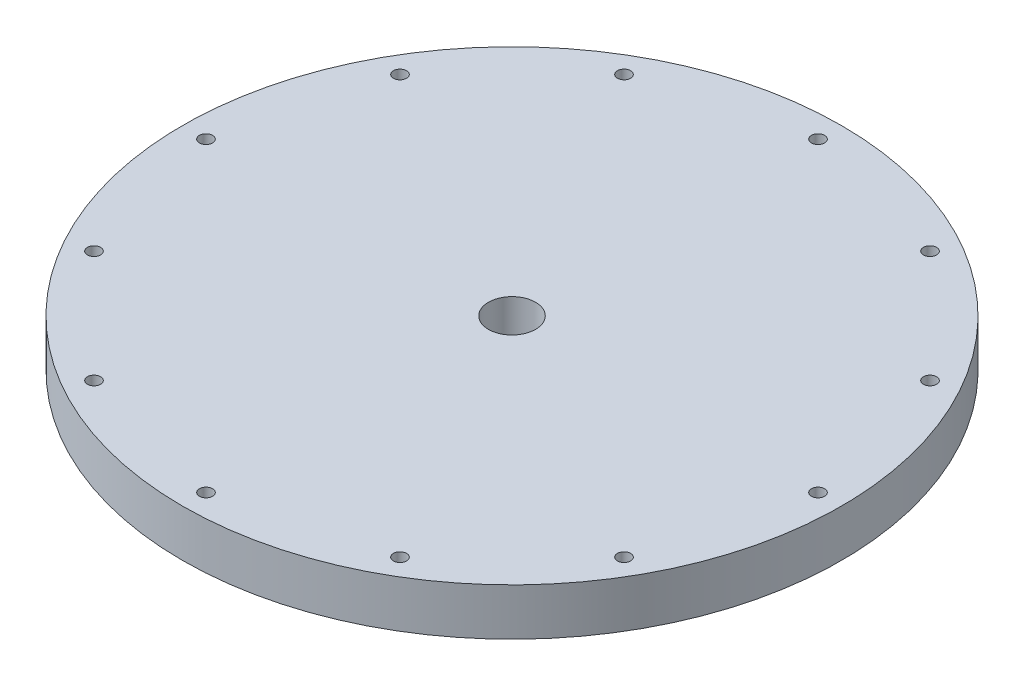
ISO-10303-21;
HEADER;
FILE_DESCRIPTION(('STEP AP214'),'2;1');
FILE_NAME('part.step','',(''),(''),'','','');
FILE_SCHEMA(('AUTOMOTIVE_DESIGN { 1 0 10303 214 1 1 1 1 }'));
ENDSEC;
DATA;
#1=APPLICATION_CONTEXT('core data for automotive mechanical design processes');
#2=APPLICATION_PROTOCOL_DEFINITION('international standard','automotive_design',2000,#1);
#3=PRODUCT_CONTEXT('',#1,'mechanical');
#4=PRODUCT('Part','Part','',(#3));
#5=PRODUCT_RELATED_PRODUCT_CATEGORY('part','',(#4));
#6=PRODUCT_DEFINITION_FORMATION('','',#4);
#7=PRODUCT_DEFINITION_CONTEXT('part definition',#1,'design');
#8=PRODUCT_DEFINITION('design','',#6,#7);
#9=PRODUCT_DEFINITION_SHAPE('','',#8);
#10=(LENGTH_UNIT() NAMED_UNIT(*) SI_UNIT(.MILLI.,.METRE.));
#11=(NAMED_UNIT(*) PLANE_ANGLE_UNIT() SI_UNIT($,.RADIAN.));
#12=(NAMED_UNIT(*) SI_UNIT($,.STERADIAN.) SOLID_ANGLE_UNIT());
#13=UNCERTAINTY_MEASURE_WITH_UNIT(LENGTH_MEASURE(1.E-05),#10,'distance_accuracy_value','');
#14=(GEOMETRIC_REPRESENTATION_CONTEXT(3) GLOBAL_UNCERTAINTY_ASSIGNED_CONTEXT((#13)) GLOBAL_UNIT_ASSIGNED_CONTEXT((#10,
#11,#12)) REPRESENTATION_CONTEXT('',''));
#15=CARTESIAN_POINT('',(0.,0.,0.));
#16=DIRECTION('',(0.,0.,1.));
#17=DIRECTION('',(1.,0.,0.));
#18=AXIS2_PLACEMENT_3D('',#15,#16,#17);
#19=CARTESIAN_POINT('',(0.,49.967071373296,0.));
#20=DIRECTION('',(0.,1.,0.));
#21=DIRECTION('',(0.,0.,1.));
#22=AXIS2_PLACEMENT_3D('',#19,#20,#21);
#23=CYLINDRICAL_SURFACE('',#22,3.175);
#24=CARTESIAN_POINT('',(0.,1.20218446601942,0.));
#25=DIRECTION('',(0.,1.,0.));
#26=DIRECTION('',(0.,0.,1.));
#27=AXIS2_PLACEMENT_3D('',#24,#25,#26);
#28=CIRCLE('',#27,3.175);
#29=CARTESIAN_POINT('',(0.,1.20218446601942,3.175));
#30=VERTEX_POINT('',#29);
#31=EDGE_CURVE('E45',#30,#30,#28,.T.);
#32=ORIENTED_EDGE('',*,*,#31,.T.);
#33=EDGE_LOOP('',(#32));
#34=FACE_BOUND('',#33,.T.);
#35=CARTESIAN_POINT('',(0.,-5.14781553398058,0.));
#36=DIRECTION('',(0.,1.,0.));
#37=DIRECTION('',(0.,0.,1.));
#38=AXIS2_PLACEMENT_3D('',#35,#36,#37);
#39=CIRCLE('',#38,3.175);
#40=CARTESIAN_POINT('',(0.,-5.14781553398058,3.175));
#41=VERTEX_POINT('',#40);
#42=EDGE_CURVE('E10',#41,#41,#39,.T.);
#43=ORIENTED_EDGE('',*,*,#42,.F.);
#44=EDGE_LOOP('',(#43));
#45=FACE_BOUND('',#44,.T.);
#46=ADVANCED_FACE('F31',(#34,#45),#23,.F.);
#47=CARTESIAN_POINT('',(-38.1,-5.14781553398059,0.));
#48=DIRECTION('',(0.,-1.,0.));
#49=DIRECTION('',(0.,0.,-1.));
#50=AXIS2_PLACEMENT_3D('',#47,#48,#49);
#51=PLANE('',#50);
#52=CARTESIAN_POINT('',(-35.7451985412027,-5.14781553398059,-20.6375));
#53=DIRECTION('',(0.,-1.,0.));
#54=DIRECTION('',(0.,0.,-1.));
#55=AXIS2_PLACEMENT_3D('',#52,#53,#54);
#56=CIRCLE('',#55,0.889);
#57=CARTESIAN_POINT('',(-35.7451985412027,-5.14781553398059,-21.5265));
#58=VERTEX_POINT('',#57);
#59=EDGE_CURVE('E56',#58,#58,#56,.T.);
#60=ORIENTED_EDGE('',*,*,#59,.F.);
#61=EDGE_LOOP('',(#60));
#62=FACE_BOUND('',#61,.T.);
#63=CARTESIAN_POINT('',(-20.6374999999999,-5.14781553398059,-35.7451985412028));
#64=DIRECTION('',(0.,-1.,0.));
#65=DIRECTION('',(0.,0.,-1.));
#66=AXIS2_PLACEMENT_3D('',#63,#64,#65);
#67=CIRCLE('',#66,0.889000000000005);
#68=CARTESIAN_POINT('',(-20.6374999999999,-5.14781553398059,-36.6341985412028));
#69=VERTEX_POINT('',#68);
#70=EDGE_CURVE('E59',#69,#69,#67,.T.);
#71=ORIENTED_EDGE('',*,*,#70,.F.);
#72=EDGE_LOOP('',(#71));
#73=FACE_BOUND('',#72,.T.);
#74=CARTESIAN_POINT('',(1.4411089226075E-13,-5.14781553398059,-41.275));
#75=DIRECTION('',(0.,-1.,0.));
#76=DIRECTION('',(0.,0.,-1.));
#77=AXIS2_PLACEMENT_3D('',#74,#75,#76);
#78=CIRCLE('',#77,0.889000000000002);
#79=CARTESIAN_POINT('',(1.4411089226075E-13,-5.14781553398059,-42.164));
#80=VERTEX_POINT('',#79);
#81=EDGE_CURVE('E62',#80,#80,#78,.T.);
#82=ORIENTED_EDGE('',*,*,#81,.F.);
#83=EDGE_LOOP('',(#82));
#84=FACE_BOUND('',#83,.T.);
#85=CARTESIAN_POINT('',(20.6375000000002,-5.14781553398059,-35.7451985412026));
#86=DIRECTION('',(0.,-1.,0.));
#87=DIRECTION('',(0.,0.,-1.));
#88=AXIS2_PLACEMENT_3D('',#85,#86,#87);
#89=CIRCLE('',#88,0.889);
#90=CARTESIAN_POINT('',(20.6375000000002,-5.14781553398059,-36.6341985412026));
#91=VERTEX_POINT('',#90);
#92=EDGE_CURVE('E65',#91,#91,#89,.T.);
#93=ORIENTED_EDGE('',*,*,#92,.F.);
#94=EDGE_LOOP('',(#93));
#95=FACE_BOUND('',#94,.T.);
#96=CARTESIAN_POINT('',(35.7451985412028,-5.14781553398059,-20.6374999999998));
#97=DIRECTION('',(0.,-1.,0.));
#98=DIRECTION('',(0.,0.,-1.));
#99=AXIS2_PLACEMENT_3D('',#96,#97,#98);
#100=CIRCLE('',#99,0.889000000000005);
#101=CARTESIAN_POINT('',(35.7451985412028,-5.14781553398059,-21.5264999999998));
#102=VERTEX_POINT('',#101);
#103=EDGE_CURVE('E68',#102,#102,#100,.T.);
#104=ORIENTED_EDGE('',*,*,#103,.F.);
#105=EDGE_LOOP('',(#104));
#106=FACE_BOUND('',#105,.T.);
#107=CARTESIAN_POINT('',(41.275,-5.14781553398059,2.88221784521501E-13));
#108=DIRECTION('',(0.,-1.,0.));
#109=DIRECTION('',(0.,0.,-1.));
#110=AXIS2_PLACEMENT_3D('',#107,#108,#109);
#111=CIRCLE('',#110,0.889000000000001);
#112=CARTESIAN_POINT('',(41.275,-5.14781553398059,-0.888999999999713));
#113=VERTEX_POINT('',#112);
#114=EDGE_CURVE('E71',#113,#113,#111,.T.);
#115=ORIENTED_EDGE('',*,*,#114,.F.);
#116=EDGE_LOOP('',(#115));
#117=FACE_BOUND('',#116,.T.);
#118=CARTESIAN_POINT('',(35.7451985412025,-5.14781553398059,20.6375000000003));
#119=DIRECTION('',(0.,-1.,0.));
#120=DIRECTION('',(0.,0.,-1.));
#121=AXIS2_PLACEMENT_3D('',#118,#119,#120);
#122=CIRCLE('',#121,0.889000000000001);
#123=CARTESIAN_POINT('',(35.7451985412025,-5.14781553398059,19.7485000000003));
#124=VERTEX_POINT('',#123);
#125=EDGE_CURVE('E74',#124,#124,#122,.T.);
#126=ORIENTED_EDGE('',*,*,#125,.F.);
#127=EDGE_LOOP('',(#126));
#128=FACE_BOUND('',#127,.T.);
#129=CARTESIAN_POINT('',(20.6374999999997,-5.14781553398059,35.7451985412029));
#130=DIRECTION('',(0.,-1.,0.));
#131=DIRECTION('',(0.,0.,-1.));
#132=AXIS2_PLACEMENT_3D('',#129,#130,#131);
#133=CIRCLE('',#132,0.889000000000002);
#134=CARTESIAN_POINT('',(20.6374999999997,-5.14781553398059,34.8561985412029));
#135=VERTEX_POINT('',#134);
#136=EDGE_CURVE('E77',#135,#135,#133,.T.);
#137=ORIENTED_EDGE('',*,*,#136,.F.);
#138=EDGE_LOOP('',(#137));
#139=FACE_BOUND('',#138,.T.);
#140=CARTESIAN_POINT('',(-4.32332676782251E-13,-5.14781553398059,41.275));
#141=DIRECTION('',(0.,-1.,0.));
#142=DIRECTION('',(0.,0.,-1.));
#143=AXIS2_PLACEMENT_3D('',#140,#141,#142);
#144=CIRCLE('',#143,0.889000000000001);
#145=CARTESIAN_POINT('',(-4.32332676782251E-13,-5.14781553398059,40.386));
#146=VERTEX_POINT('',#145);
#147=EDGE_CURVE('E80',#146,#146,#144,.T.);
#148=ORIENTED_EDGE('',*,*,#147,.F.);
#149=EDGE_LOOP('',(#148));
#150=FACE_BOUND('',#149,.T.);
#151=CARTESIAN_POINT('',(-20.6375000000004,-5.14781553398059,35.7451985412025));
#152=DIRECTION('',(0.,-1.,0.));
#153=DIRECTION('',(0.,0.,-1.));
#154=AXIS2_PLACEMENT_3D('',#151,#152,#153);
#155=CIRCLE('',#154,0.889000000000008);
#156=CARTESIAN_POINT('',(-20.6375000000004,-5.14781553398059,34.8561985412025));
#157=VERTEX_POINT('',#156);
#158=EDGE_CURVE('E83',#157,#157,#155,.T.);
#159=ORIENTED_EDGE('',*,*,#158,.F.);
#160=EDGE_LOOP('',(#159));
#161=FACE_BOUND('',#160,.T.);
#162=CARTESIAN_POINT('',(-35.745198541203,-5.14781553398059,20.6374999999995));
#163=DIRECTION('',(0.,-1.,0.));
#164=DIRECTION('',(0.,0.,-1.));
#165=AXIS2_PLACEMENT_3D('',#162,#163,#164);
#166=CIRCLE('',#165,0.889);
#167=CARTESIAN_POINT('',(-35.745198541203,-5.14781553398059,19.7484999999995));
#168=VERTEX_POINT('',#167);
#169=EDGE_CURVE('E86',#168,#168,#166,.T.);
#170=ORIENTED_EDGE('',*,*,#169,.F.);
#171=EDGE_LOOP('',(#170));
#172=FACE_BOUND('',#171,.T.);
#173=CARTESIAN_POINT('',(-41.275,-5.14781553398059,0.));
#174=DIRECTION('',(0.,-1.,0.));
#175=DIRECTION('',(0.,0.,-1.));
#176=AXIS2_PLACEMENT_3D('',#173,#174,#175);
#177=CIRCLE('',#176,0.889000000000003);
#178=CARTESIAN_POINT('',(-41.275,-5.14781553398059,-0.889000000000003));
#179=VERTEX_POINT('',#178);
#180=EDGE_CURVE('E50',#179,#179,#177,.T.);
#181=ORIENTED_EDGE('',*,*,#180,.F.);
#182=EDGE_LOOP('',(#181));
#183=FACE_BOUND('',#182,.T.);
#184=ORIENTED_EDGE('',*,*,#42,.T.);
#185=EDGE_LOOP('',(#184));
#186=FACE_BOUND('',#185,.T.);
#187=CARTESIAN_POINT('',(0.,-5.14781553398059,0.));
#188=DIRECTION('',(0.,1.,0.));
#189=DIRECTION('',(0.,0.,1.));
#190=AXIS2_PLACEMENT_3D('',#187,#188,#189);
#191=CIRCLE('',#190,44.45);
#192=CARTESIAN_POINT('',(0.,-5.14781553398059,44.45));
#193=VERTEX_POINT('',#192);
#194=EDGE_CURVE('E37',#193,#193,#191,.T.);
#195=ORIENTED_EDGE('',*,*,#194,.F.);
#196=EDGE_LOOP('',(#195));
#197=FACE_BOUND('',#196,.T.);
#198=ADVANCED_FACE('F159',(#62,#73,#84,#95,#106,#117,#128,#139,#150,#161,#172,#183,#186,#197),
#51,.T.);
#199=CARTESIAN_POINT('',(0.,49.967071373296,0.));
#200=DIRECTION('',(0.,1.,0.));
#201=DIRECTION('',(0.,0.,1.));
#202=AXIS2_PLACEMENT_3D('',#199,#200,#201);
#203=CYLINDRICAL_SURFACE('',#202,44.45);
#204=ORIENTED_EDGE('',*,*,#194,.T.);
#205=EDGE_LOOP('',(#204));
#206=FACE_BOUND('',#205,.T.);
#207=CARTESIAN_POINT('',(0.,1.20218446601941,0.));
#208=DIRECTION('',(0.,1.,0.));
#209=DIRECTION('',(0.,0.,1.));
#210=AXIS2_PLACEMENT_3D('',#207,#208,#209);
#211=CIRCLE('',#210,44.45);
#212=CARTESIAN_POINT('',(0.,1.20218446601941,44.45));
#213=VERTEX_POINT('',#212);
#214=EDGE_CURVE('E41',#213,#213,#211,.T.);
#215=ORIENTED_EDGE('',*,*,#214,.F.);
#216=EDGE_LOOP('',(#215));
#217=FACE_BOUND('',#216,.T.);
#218=ADVANCED_FACE('F129',(#206,#217),#203,.T.);
#219=CARTESIAN_POINT('',(-3.175,1.20218446601941,0.));
#220=DIRECTION('',(0.,1.,0.));
#221=DIRECTION('',(0.,0.,1.));
#222=AXIS2_PLACEMENT_3D('',#219,#220,#221);
#223=PLANE('',#222);
#224=CARTESIAN_POINT('',(-35.7451985412027,1.20218446601941,-20.6375));
#225=DIRECTION('',(0.,1.,0.));
#226=DIRECTION('',(0.,0.,1.));
#227=AXIS2_PLACEMENT_3D('',#224,#225,#226);
#228=CIRCLE('',#227,0.889);
#229=CARTESIAN_POINT('',(-35.7451985412027,1.20218446601941,-19.7485));
#230=VERTEX_POINT('',#229);
#231=EDGE_CURVE('E89',#230,#230,#228,.T.);
#232=ORIENTED_EDGE('',*,*,#231,.F.);
#233=EDGE_LOOP('',(#232));
#234=FACE_BOUND('',#233,.T.);
#235=CARTESIAN_POINT('',(-20.6374999999999,1.20218446601941,-35.7451985412028));
#236=DIRECTION('',(0.,1.,0.));
#237=DIRECTION('',(0.,0.,1.));
#238=AXIS2_PLACEMENT_3D('',#235,#236,#237);
#239=CIRCLE('',#238,0.889000000000005);
#240=CARTESIAN_POINT('',(-20.6374999999999,1.20218446601941,-34.8561985412027));
#241=VERTEX_POINT('',#240);
#242=EDGE_CURVE('E117',#241,#241,#239,.T.);
#243=ORIENTED_EDGE('',*,*,#242,.F.);
#244=EDGE_LOOP('',(#243));
#245=FACE_BOUND('',#244,.T.);
#246=CARTESIAN_POINT('',(1.4411089226075E-13,1.20218446601941,-41.275));
#247=DIRECTION('',(0.,1.,0.));
#248=DIRECTION('',(0.,0.,1.));
#249=AXIS2_PLACEMENT_3D('',#246,#247,#248);
#250=CIRCLE('',#249,0.889000000000002);
#251=CARTESIAN_POINT('',(1.4411089226075E-13,1.20218446601941,-40.386));
#252=VERTEX_POINT('',#251);
#253=EDGE_CURVE('E114',#252,#252,#250,.T.);
#254=ORIENTED_EDGE('',*,*,#253,.F.);
#255=EDGE_LOOP('',(#254));
#256=FACE_BOUND('',#255,.T.);
#257=CARTESIAN_POINT('',(20.6375000000002,1.20218446601941,-35.7451985412026));
#258=DIRECTION('',(0.,1.,0.));
#259=DIRECTION('',(0.,0.,1.));
#260=AXIS2_PLACEMENT_3D('',#257,#258,#259);
#261=CIRCLE('',#260,0.889);
#262=CARTESIAN_POINT('',(20.6375000000002,1.20218446601941,-34.8561985412026));
#263=VERTEX_POINT('',#262);
#264=EDGE_CURVE('E111',#263,#263,#261,.T.);
#265=ORIENTED_EDGE('',*,*,#264,.F.);
#266=EDGE_LOOP('',(#265));
#267=FACE_BOUND('',#266,.T.);
#268=CARTESIAN_POINT('',(35.7451985412028,1.20218446601941,-20.6374999999998));
#269=DIRECTION('',(0.,1.,0.));
#270=DIRECTION('',(0.,0.,1.));
#271=AXIS2_PLACEMENT_3D('',#268,#269,#270);
#272=CIRCLE('',#271,0.889000000000005);
#273=CARTESIAN_POINT('',(35.7451985412028,1.20218446601941,-19.7484999999998));
#274=VERTEX_POINT('',#273);
#275=EDGE_CURVE('E108',#274,#274,#272,.T.);
#276=ORIENTED_EDGE('',*,*,#275,.F.);
#277=EDGE_LOOP('',(#276));
#278=FACE_BOUND('',#277,.T.);
#279=CARTESIAN_POINT('',(41.275,1.20218446601941,2.88221784521501E-13));
#280=DIRECTION('',(0.,1.,0.));
#281=DIRECTION('',(0.,0.,1.));
#282=AXIS2_PLACEMENT_3D('',#279,#280,#281);
#283=CIRCLE('',#282,0.889000000000001);
#284=CARTESIAN_POINT('',(41.275,1.20218446601941,0.88900000000029));
#285=VERTEX_POINT('',#284);
#286=EDGE_CURVE('E105',#285,#285,#283,.T.);
#287=ORIENTED_EDGE('',*,*,#286,.F.);
#288=EDGE_LOOP('',(#287));
#289=FACE_BOUND('',#288,.T.);
#290=CARTESIAN_POINT('',(35.7451985412025,1.20218446601941,20.6375000000003));
#291=DIRECTION('',(0.,1.,0.));
#292=DIRECTION('',(0.,0.,1.));
#293=AXIS2_PLACEMENT_3D('',#290,#291,#292);
#294=CIRCLE('',#293,0.889000000000001);
#295=CARTESIAN_POINT('',(35.7451985412025,1.20218446601941,21.5265000000003));
#296=VERTEX_POINT('',#295);
#297=EDGE_CURVE('E102',#296,#296,#294,.T.);
#298=ORIENTED_EDGE('',*,*,#297,.F.);
#299=EDGE_LOOP('',(#298));
#300=FACE_BOUND('',#299,.T.);
#301=CARTESIAN_POINT('',(20.6374999999997,1.20218446601941,35.7451985412029));
#302=DIRECTION('',(0.,1.,0.));
#303=DIRECTION('',(0.,0.,1.));
#304=AXIS2_PLACEMENT_3D('',#301,#302,#303);
#305=CIRCLE('',#304,0.889000000000002);
#306=CARTESIAN_POINT('',(20.6374999999997,1.20218446601941,36.6341985412029));
#307=VERTEX_POINT('',#306);
#308=EDGE_CURVE('E99',#307,#307,#305,.T.);
#309=ORIENTED_EDGE('',*,*,#308,.F.);
#310=EDGE_LOOP('',(#309));
#311=FACE_BOUND('',#310,.T.);
#312=CARTESIAN_POINT('',(-4.32332676782251E-13,1.20218446601941,41.275));
#313=DIRECTION('',(0.,1.,0.));
#314=DIRECTION('',(0.,0.,1.));
#315=AXIS2_PLACEMENT_3D('',#312,#313,#314);
#316=CIRCLE('',#315,0.889000000000001);
#317=CARTESIAN_POINT('',(-4.32332676782251E-13,1.20218446601941,42.164));
#318=VERTEX_POINT('',#317);
#319=EDGE_CURVE('E96',#318,#318,#316,.T.);
#320=ORIENTED_EDGE('',*,*,#319,.F.);
#321=EDGE_LOOP('',(#320));
#322=FACE_BOUND('',#321,.T.);
#323=CARTESIAN_POINT('',(-20.6375000000004,1.20218446601941,35.7451985412025));
#324=DIRECTION('',(0.,1.,0.));
#325=DIRECTION('',(0.,0.,1.));
#326=AXIS2_PLACEMENT_3D('',#323,#324,#325);
#327=CIRCLE('',#326,0.889000000000008);
#328=CARTESIAN_POINT('',(-20.6375000000004,1.20218446601941,36.6341985412025));
#329=VERTEX_POINT('',#328);
#330=EDGE_CURVE('E93',#329,#329,#327,.T.);
#331=ORIENTED_EDGE('',*,*,#330,.F.);
#332=EDGE_LOOP('',(#331));
#333=FACE_BOUND('',#332,.T.);
#334=CARTESIAN_POINT('',(-35.745198541203,1.20218446601941,20.6374999999995));
#335=DIRECTION('',(0.,1.,0.));
#336=DIRECTION('',(0.,0.,1.));
#337=AXIS2_PLACEMENT_3D('',#334,#335,#336);
#338=CIRCLE('',#337,0.889);
#339=CARTESIAN_POINT('',(-35.745198541203,1.20218446601941,21.5264999999995));
#340=VERTEX_POINT('',#339);
#341=EDGE_CURVE('E90',#340,#340,#338,.T.);
#342=ORIENTED_EDGE('',*,*,#341,.F.);
#343=EDGE_LOOP('',(#342));
#344=FACE_BOUND('',#343,.T.);
#345=CARTESIAN_POINT('',(-41.275,1.20218446601941,0.));
#346=DIRECTION('',(0.,1.,0.));
#347=DIRECTION('',(0.,0.,1.));
#348=AXIS2_PLACEMENT_3D('',#345,#346,#347);
#349=CIRCLE('',#348,0.889000000000003);
#350=CARTESIAN_POINT('',(-41.275,1.20218446601941,0.889000000000003));
#351=VERTEX_POINT('',#350);
#352=EDGE_CURVE('E53',#351,#351,#349,.T.);
#353=ORIENTED_EDGE('',*,*,#352,.F.);
#354=EDGE_LOOP('',(#353));
#355=FACE_BOUND('',#354,.T.);
#356=ORIENTED_EDGE('',*,*,#214,.T.);
#357=EDGE_LOOP('',(#356));
#358=FACE_BOUND('',#357,.T.);
#359=ORIENTED_EDGE('',*,*,#31,.F.);
#360=EDGE_LOOP('',(#359));
#361=FACE_BOUND('',#360,.T.);
#362=ADVANCED_FACE('F125',(#234,#245,#256,#267,#278,#289,#300,#311,#322,#333,#344,#355,#358,
#361),#223,.T.);
#363=CARTESIAN_POINT('',(-41.275,-11.4978155339806,0.));
#364=DIRECTION('',(0.,1.,0.));
#365=DIRECTION('',(0.,0.,1.));
#366=AXIS2_PLACEMENT_3D('',#363,#364,#365);
#367=CYLINDRICAL_SURFACE('',#366,0.889000000000003);
#368=ORIENTED_EDGE('',*,*,#180,.T.);
#369=EDGE_LOOP('',(#368));
#370=FACE_BOUND('',#369,.T.);
#371=ORIENTED_EDGE('',*,*,#352,.T.);
#372=EDGE_LOOP('',(#371));
#373=FACE_BOUND('',#372,.T.);
#374=ADVANCED_FACE('F128',(#370,#373),#367,.F.);
#375=CARTESIAN_POINT('',(-35.745198541203,-11.4978155339806,20.6374999999995));
#376=DIRECTION('',(0.,1.,0.));
#377=DIRECTION('',(0.,0.,1.));
#378=AXIS2_PLACEMENT_3D('',#375,#376,#377);
#379=CYLINDRICAL_SURFACE('',#378,0.889);
#380=ORIENTED_EDGE('',*,*,#169,.T.);
#381=EDGE_LOOP('',(#380));
#382=FACE_BOUND('',#381,.T.);
#383=ORIENTED_EDGE('',*,*,#341,.T.);
#384=EDGE_LOOP('',(#383));
#385=FACE_BOUND('',#384,.T.);
#386=ADVANCED_FACE('F173',(#382,#385),#379,.F.);
#387=CARTESIAN_POINT('',(-20.6375000000004,-11.4978155339806,35.7451985412025));
#388=DIRECTION('',(0.,1.,0.));
#389=DIRECTION('',(0.,0.,1.));
#390=AXIS2_PLACEMENT_3D('',#387,#388,#389);
#391=CYLINDRICAL_SURFACE('',#390,0.889000000000008);
#392=ORIENTED_EDGE('',*,*,#158,.T.);
#393=EDGE_LOOP('',(#392));
#394=FACE_BOUND('',#393,.T.);
#395=ORIENTED_EDGE('',*,*,#330,.T.);
#396=EDGE_LOOP('',(#395));
#397=FACE_BOUND('',#396,.T.);
#398=ADVANCED_FACE('F177',(#394,#397),#391,.F.);
#399=CARTESIAN_POINT('',(-4.32332676782251E-13,-11.4978155339806,41.275));
#400=DIRECTION('',(0.,1.,0.));
#401=DIRECTION('',(0.,0.,1.));
#402=AXIS2_PLACEMENT_3D('',#399,#400,#401);
#403=CYLINDRICAL_SURFACE('',#402,0.889000000000001);
#404=ORIENTED_EDGE('',*,*,#147,.T.);
#405=EDGE_LOOP('',(#404));
#406=FACE_BOUND('',#405,.T.);
#407=ORIENTED_EDGE('',*,*,#319,.T.);
#408=EDGE_LOOP('',(#407));
#409=FACE_BOUND('',#408,.T.);
#410=ADVANCED_FACE('F181',(#406,#409),#403,.F.);
#411=CARTESIAN_POINT('',(20.6374999999997,-11.4978155339806,35.7451985412029));
#412=DIRECTION('',(0.,1.,0.));
#413=DIRECTION('',(0.,0.,1.));
#414=AXIS2_PLACEMENT_3D('',#411,#412,#413);
#415=CYLINDRICAL_SURFACE('',#414,0.889000000000002);
#416=ORIENTED_EDGE('',*,*,#136,.T.);
#417=EDGE_LOOP('',(#416));
#418=FACE_BOUND('',#417,.T.);
#419=ORIENTED_EDGE('',*,*,#308,.T.);
#420=EDGE_LOOP('',(#419));
#421=FACE_BOUND('',#420,.T.);
#422=ADVANCED_FACE('F185',(#418,#421),#415,.F.);
#423=CARTESIAN_POINT('',(35.7451985412025,-11.4978155339806,20.6375000000003));
#424=DIRECTION('',(0.,1.,0.));
#425=DIRECTION('',(0.,0.,1.));
#426=AXIS2_PLACEMENT_3D('',#423,#424,#425);
#427=CYLINDRICAL_SURFACE('',#426,0.889000000000001);
#428=ORIENTED_EDGE('',*,*,#125,.T.);
#429=EDGE_LOOP('',(#428));
#430=FACE_BOUND('',#429,.T.);
#431=ORIENTED_EDGE('',*,*,#297,.T.);
#432=EDGE_LOOP('',(#431));
#433=FACE_BOUND('',#432,.T.);
#434=ADVANCED_FACE('F189',(#430,#433),#427,.F.);
#435=CARTESIAN_POINT('',(41.275,-11.4978155339806,2.88221784521501E-13));
#436=DIRECTION('',(0.,1.,0.));
#437=DIRECTION('',(0.,0.,1.));
#438=AXIS2_PLACEMENT_3D('',#435,#436,#437);
#439=CYLINDRICAL_SURFACE('',#438,0.889000000000001);
#440=ORIENTED_EDGE('',*,*,#114,.T.);
#441=EDGE_LOOP('',(#440));
#442=FACE_BOUND('',#441,.T.);
#443=ORIENTED_EDGE('',*,*,#286,.T.);
#444=EDGE_LOOP('',(#443));
#445=FACE_BOUND('',#444,.T.);
#446=ADVANCED_FACE('F193',(#442,#445),#439,.F.);
#447=CARTESIAN_POINT('',(35.7451985412028,-11.4978155339806,-20.6374999999998));
#448=DIRECTION('',(0.,1.,0.));
#449=DIRECTION('',(0.,0.,1.));
#450=AXIS2_PLACEMENT_3D('',#447,#448,#449);
#451=CYLINDRICAL_SURFACE('',#450,0.889000000000005);
#452=ORIENTED_EDGE('',*,*,#103,.T.);
#453=EDGE_LOOP('',(#452));
#454=FACE_BOUND('',#453,.T.);
#455=ORIENTED_EDGE('',*,*,#275,.T.);
#456=EDGE_LOOP('',(#455));
#457=FACE_BOUND('',#456,.T.);
#458=ADVANCED_FACE('F197',(#454,#457),#451,.F.);
#459=CARTESIAN_POINT('',(20.6375000000002,-11.4978155339806,-35.7451985412026));
#460=DIRECTION('',(0.,1.,0.));
#461=DIRECTION('',(0.,0.,1.));
#462=AXIS2_PLACEMENT_3D('',#459,#460,#461);
#463=CYLINDRICAL_SURFACE('',#462,0.889);
#464=ORIENTED_EDGE('',*,*,#92,.T.);
#465=EDGE_LOOP('',(#464));
#466=FACE_BOUND('',#465,.T.);
#467=ORIENTED_EDGE('',*,*,#264,.T.);
#468=EDGE_LOOP('',(#467));
#469=FACE_BOUND('',#468,.T.);
#470=ADVANCED_FACE('F201',(#466,#469),#463,.F.);
#471=CARTESIAN_POINT('',(1.4411089226075E-13,-11.4978155339806,-41.275));
#472=DIRECTION('',(0.,1.,0.));
#473=DIRECTION('',(0.,0.,1.));
#474=AXIS2_PLACEMENT_3D('',#471,#472,#473);
#475=CYLINDRICAL_SURFACE('',#474,0.889000000000002);
#476=ORIENTED_EDGE('',*,*,#81,.T.);
#477=EDGE_LOOP('',(#476));
#478=FACE_BOUND('',#477,.T.);
#479=ORIENTED_EDGE('',*,*,#253,.T.);
#480=EDGE_LOOP('',(#479));
#481=FACE_BOUND('',#480,.T.);
#482=ADVANCED_FACE('F205',(#478,#481),#475,.F.);
#483=CARTESIAN_POINT('',(-20.6374999999999,-11.4978155339806,-35.7451985412028));
#484=DIRECTION('',(0.,1.,0.));
#485=DIRECTION('',(0.,0.,1.));
#486=AXIS2_PLACEMENT_3D('',#483,#484,#485);
#487=CYLINDRICAL_SURFACE('',#486,0.889000000000005);
#488=ORIENTED_EDGE('',*,*,#70,.T.);
#489=EDGE_LOOP('',(#488));
#490=FACE_BOUND('',#489,.T.);
#491=ORIENTED_EDGE('',*,*,#242,.T.);
#492=EDGE_LOOP('',(#491));
#493=FACE_BOUND('',#492,.T.);
#494=ADVANCED_FACE('F209',(#490,#493),#487,.F.);
#495=CARTESIAN_POINT('',(-35.7451985412027,-11.4978155339806,-20.6375));
#496=DIRECTION('',(0.,1.,0.));
#497=DIRECTION('',(0.,0.,1.));
#498=AXIS2_PLACEMENT_3D('',#495,#496,#497);
#499=CYLINDRICAL_SURFACE('',#498,0.889);
#500=ORIENTED_EDGE('',*,*,#59,.T.);
#501=EDGE_LOOP('',(#500));
#502=FACE_BOUND('',#501,.T.);
#503=ORIENTED_EDGE('',*,*,#231,.T.);
#504=EDGE_LOOP('',(#503));
#505=FACE_BOUND('',#504,.T.);
#506=ADVANCED_FACE('F123',(#502,#505),#499,.F.);
#507=CLOSED_SHELL('',(#46,#198,#218,#362,#374,#386,#398,#410,#422,#434,#446,#458,#470,#482,#494,#506));
#508=MANIFOLD_SOLID_BREP('B2',#507);
#509=ADVANCED_BREP_SHAPE_REPRESENTATION('',(#18,#508),#14);
#510=SHAPE_DEFINITION_REPRESENTATION(#9,#509);
ENDSEC;
END-ISO-10303-21;
